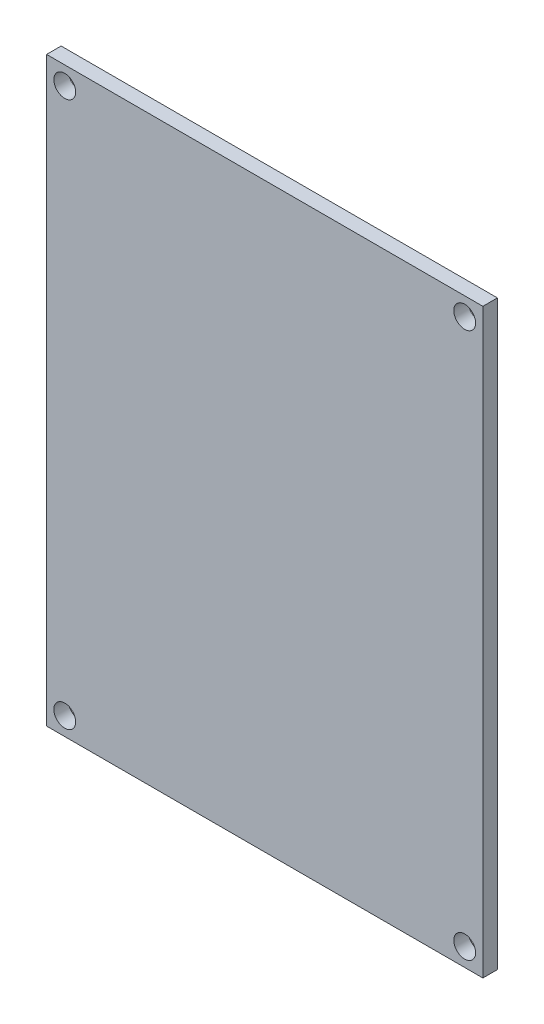
ISO-10303-21;
HEADER;
FILE_DESCRIPTION(('STEP AP214'),'2;1');
FILE_NAME('part.step','',(''),(''),'','','');
FILE_SCHEMA(('AUTOMOTIVE_DESIGN { 1 0 10303 214 1 1 1 1 }'));
ENDSEC;
DATA;
#1=APPLICATION_CONTEXT('core data for automotive mechanical design processes');
#2=APPLICATION_PROTOCOL_DEFINITION('international standard','automotive_design',2000,#1);
#3=PRODUCT_CONTEXT('',#1,'mechanical');
#4=PRODUCT('Part','Part','',(#3));
#5=PRODUCT_RELATED_PRODUCT_CATEGORY('part','',(#4));
#6=PRODUCT_DEFINITION_FORMATION('','',#4);
#7=PRODUCT_DEFINITION_CONTEXT('part definition',#1,'design');
#8=PRODUCT_DEFINITION('design','',#6,#7);
#9=PRODUCT_DEFINITION_SHAPE('','',#8);
#10=(LENGTH_UNIT() NAMED_UNIT(*) SI_UNIT(.MILLI.,.METRE.));
#11=(NAMED_UNIT(*) PLANE_ANGLE_UNIT() SI_UNIT($,.RADIAN.));
#12=(NAMED_UNIT(*) SI_UNIT($,.STERADIAN.) SOLID_ANGLE_UNIT());
#13=UNCERTAINTY_MEASURE_WITH_UNIT(LENGTH_MEASURE(1.E-05),#10,'distance_accuracy_value','');
#14=(GEOMETRIC_REPRESENTATION_CONTEXT(3) GLOBAL_UNCERTAINTY_ASSIGNED_CONTEXT((#13)) GLOBAL_UNIT_ASSIGNED_CONTEXT((#10,
#11,#12)) REPRESENTATION_CONTEXT('',''));
#15=CARTESIAN_POINT('',(0.,0.,0.));
#16=DIRECTION('',(0.,0.,1.));
#17=DIRECTION('',(1.,0.,0.));
#18=AXIS2_PLACEMENT_3D('',#15,#16,#17);
#19=CARTESIAN_POINT('',(-30.,-40.,2.));
#20=DIRECTION('',(1.,0.,0.));
#21=DIRECTION('',(0.,0.,-1.));
#22=AXIS2_PLACEMENT_3D('',#19,#20,#21);
#23=PLANE('',#22);
#24=DIRECTION('',(0.,-1.,0.));
#25=VECTOR('',#24,1.);
#26=CARTESIAN_POINT('',(-30.,-40.,0.));
#27=LINE('',#26,#25);
#28=CARTESIAN_POINT('',(-30.,40.,0.));
#29=VERTEX_POINT('',#28);
#30=CARTESIAN_POINT('',(-30.,-40.,0.));
#31=VERTEX_POINT('',#30);
#32=EDGE_CURVE('E96',#29,#31,#27,.T.);
#33=ORIENTED_EDGE('',*,*,#32,.T.);
#34=DIRECTION('',(0.,0.,-1.));
#35=VECTOR('',#34,1.);
#36=CARTESIAN_POINT('',(-30.,-40.,2.));
#37=LINE('',#36,#35);
#38=CARTESIAN_POINT('',(-30.,-40.,2.));
#39=VERTEX_POINT('',#38);
#40=EDGE_CURVE('E11',#39,#31,#37,.T.);
#41=ORIENTED_EDGE('',*,*,#40,.F.);
#42=DIRECTION('',(0.,-1.,0.));
#43=VECTOR('',#42,1.);
#44=CARTESIAN_POINT('',(-30.,-40.,2.));
#45=LINE('',#44,#43);
#46=CARTESIAN_POINT('',(-30.,40.,2.));
#47=VERTEX_POINT('',#46);
#48=EDGE_CURVE('E84',#47,#39,#45,.T.);
#49=ORIENTED_EDGE('',*,*,#48,.F.);
#50=DIRECTION('',(0.,0.,-1.));
#51=VECTOR('',#50,1.);
#52=CARTESIAN_POINT('',(-30.,40.,2.));
#53=LINE('',#52,#51);
#54=EDGE_CURVE('E92',#47,#29,#53,.T.);
#55=ORIENTED_EDGE('',*,*,#54,.T.);
#56=EDGE_LOOP('',(#33,#41,#49,#55));
#57=FACE_BOUND('',#56,.T.);
#58=ADVANCED_FACE('F33',(#57),#23,.F.);
#59=CARTESIAN_POINT('',(30.,-40.,2.));
#60=DIRECTION('',(0.,1.,0.));
#61=DIRECTION('',(0.,0.,1.));
#62=AXIS2_PLACEMENT_3D('',#59,#60,#61);
#63=PLANE('',#62);
#64=DIRECTION('',(1.,0.,0.));
#65=VECTOR('',#64,1.);
#66=CARTESIAN_POINT('',(30.,-40.,0.));
#67=LINE('',#66,#65);
#68=CARTESIAN_POINT('',(30.,-40.,0.));
#69=VERTEX_POINT('',#68);
#70=EDGE_CURVE('E88',#31,#69,#67,.T.);
#71=ORIENTED_EDGE('',*,*,#70,.T.);
#72=DIRECTION('',(0.,0.,-1.));
#73=VECTOR('',#72,1.);
#74=CARTESIAN_POINT('',(30.,-40.,2.));
#75=LINE('',#74,#73);
#76=CARTESIAN_POINT('',(30.,-40.,2.));
#77=VERTEX_POINT('',#76);
#78=EDGE_CURVE('E41',#77,#69,#75,.T.);
#79=ORIENTED_EDGE('',*,*,#78,.F.);
#80=DIRECTION('',(1.,0.,0.));
#81=VECTOR('',#80,1.);
#82=CARTESIAN_POINT('',(30.,-40.,2.));
#83=LINE('',#82,#81);
#84=EDGE_CURVE('E79',#39,#77,#83,.T.);
#85=ORIENTED_EDGE('',*,*,#84,.F.);
#86=ORIENTED_EDGE('',*,*,#40,.T.);
#87=EDGE_LOOP('',(#71,#79,#85,#86));
#88=FACE_BOUND('',#87,.T.);
#89=ADVANCED_FACE('F87',(#88),#63,.F.);
#90=CARTESIAN_POINT('',(30.,-40.,2.));
#91=DIRECTION('',(-1.,0.,0.));
#92=DIRECTION('',(0.,0.,1.));
#93=AXIS2_PLACEMENT_3D('',#90,#91,#92);
#94=PLANE('',#93);
#95=DIRECTION('',(0.,1.,0.));
#96=VECTOR('',#95,1.);
#97=CARTESIAN_POINT('',(30.,-40.,0.));
#98=LINE('',#97,#96);
#99=CARTESIAN_POINT('',(30.,40.,0.));
#100=VERTEX_POINT('',#99);
#101=EDGE_CURVE('E66',#69,#100,#98,.T.);
#102=ORIENTED_EDGE('',*,*,#101,.T.);
#103=DIRECTION('',(0.,0.,-1.));
#104=VECTOR('',#103,1.);
#105=CARTESIAN_POINT('',(30.,40.,2.));
#106=LINE('',#105,#104);
#107=CARTESIAN_POINT('',(30.,40.,2.));
#108=VERTEX_POINT('',#107);
#109=EDGE_CURVE('E89',#108,#100,#106,.T.);
#110=ORIENTED_EDGE('',*,*,#109,.F.);
#111=DIRECTION('',(0.,1.,0.));
#112=VECTOR('',#111,1.);
#113=CARTESIAN_POINT('',(30.,-40.,2.));
#114=LINE('',#113,#112);
#115=EDGE_CURVE('E82',#77,#108,#114,.T.);
#116=ORIENTED_EDGE('',*,*,#115,.F.);
#117=ORIENTED_EDGE('',*,*,#78,.T.);
#118=EDGE_LOOP('',(#102,#110,#116,#117));
#119=FACE_BOUND('',#118,.T.);
#120=ADVANCED_FACE('F90',(#119),#94,.F.);
#121=CARTESIAN_POINT('',(30.,40.,2.));
#122=DIRECTION('',(0.,-1.,0.));
#123=DIRECTION('',(0.,0.,-1.));
#124=AXIS2_PLACEMENT_3D('',#121,#122,#123);
#125=PLANE('',#124);
#126=DIRECTION('',(-1.,0.,0.));
#127=VECTOR('',#126,1.);
#128=CARTESIAN_POINT('',(30.,40.,0.));
#129=LINE('',#128,#127);
#130=EDGE_CURVE('E72',#100,#29,#129,.T.);
#131=ORIENTED_EDGE('',*,*,#130,.T.);
#132=ORIENTED_EDGE('',*,*,#54,.F.);
#133=DIRECTION('',(-1.,0.,0.));
#134=VECTOR('',#133,1.);
#135=CARTESIAN_POINT('',(30.,40.,2.));
#136=LINE('',#135,#134);
#137=EDGE_CURVE('E49',#108,#47,#136,.T.);
#138=ORIENTED_EDGE('',*,*,#137,.F.);
#139=ORIENTED_EDGE('',*,*,#109,.T.);
#140=EDGE_LOOP('',(#131,#132,#138,#139));
#141=FACE_BOUND('',#140,.T.);
#142=ADVANCED_FACE('F104',(#141),#125,.F.);
#143=CARTESIAN_POINT('',(0.,0.,2.));
#144=DIRECTION('',(0.,0.,1.));
#145=DIRECTION('',(1.,0.,0.));
#146=AXIS2_PLACEMENT_3D('',#143,#144,#145);
#147=PLANE('',#146);
#148=CARTESIAN_POINT('',(-27.4999999999998,37.5,2.));
#149=DIRECTION('',(0.,0.,1.));
#150=DIRECTION('',(1.,0.,0.));
#151=AXIS2_PLACEMENT_3D('',#148,#149,#150);
#152=CIRCLE('',#151,1.5);
#153=CARTESIAN_POINT('',(-25.9999999999998,37.5,2.));
#154=VERTEX_POINT('',#153);
#155=EDGE_CURVE('E116',#154,#154,#152,.F.);
#156=ORIENTED_EDGE('',*,*,#155,.T.);
#157=EDGE_LOOP('',(#156));
#158=FACE_BOUND('',#157,.T.);
#159=CARTESIAN_POINT('',(27.5000000000001,37.4999999999998,2.));
#160=DIRECTION('',(0.,0.,1.));
#161=DIRECTION('',(1.,0.,0.));
#162=AXIS2_PLACEMENT_3D('',#159,#160,#161);
#163=CIRCLE('',#162,1.5);
#164=CARTESIAN_POINT('',(29.0000000000001,37.4999999999998,2.));
#165=VERTEX_POINT('',#164);
#166=EDGE_CURVE('E122',#165,#165,#163,.F.);
#167=ORIENTED_EDGE('',*,*,#166,.T.);
#168=EDGE_LOOP('',(#167));
#169=FACE_BOUND('',#168,.T.);
#170=CARTESIAN_POINT('',(27.4999999999999,-37.5000000000001,2.));
#171=DIRECTION('',(0.,0.,1.));
#172=DIRECTION('',(1.,0.,0.));
#173=AXIS2_PLACEMENT_3D('',#170,#171,#172);
#174=CIRCLE('',#173,1.5);
#175=CARTESIAN_POINT('',(28.9999999999999,-37.5000000000001,2.));
#176=VERTEX_POINT('',#175);
#177=EDGE_CURVE('E128',#176,#176,#174,.F.);
#178=ORIENTED_EDGE('',*,*,#177,.T.);
#179=EDGE_LOOP('',(#178));
#180=FACE_BOUND('',#179,.T.);
#181=CARTESIAN_POINT('',(-27.5,-37.5,2.));
#182=DIRECTION('',(0.,0.,1.));
#183=DIRECTION('',(1.,0.,0.));
#184=AXIS2_PLACEMENT_3D('',#181,#182,#183);
#185=CIRCLE('',#184,1.5);
#186=CARTESIAN_POINT('',(-26.,-37.5,2.));
#187=VERTEX_POINT('',#186);
#188=EDGE_CURVE('E110',#187,#187,#185,.F.);
#189=ORIENTED_EDGE('',*,*,#188,.T.);
#190=EDGE_LOOP('',(#189));
#191=FACE_BOUND('',#190,.T.);
#192=ORIENTED_EDGE('',*,*,#48,.T.);
#193=ORIENTED_EDGE('',*,*,#84,.T.);
#194=ORIENTED_EDGE('',*,*,#115,.T.);
#195=ORIENTED_EDGE('',*,*,#137,.T.);
#196=EDGE_LOOP('',(#192,#193,#194,#195));
#197=FACE_BOUND('',#196,.T.);
#198=ADVANCED_FACE('F80',(#158,#169,#180,#191,#197),#147,.T.);
#199=CARTESIAN_POINT('',(0.,0.,0.));
#200=DIRECTION('',(0.,0.,1.));
#201=DIRECTION('',(1.,0.,0.));
#202=AXIS2_PLACEMENT_3D('',#199,#200,#201);
#203=PLANE('',#202);
#204=CARTESIAN_POINT('',(-27.4999999999998,37.5,0.));
#205=DIRECTION('',(0.,0.,-1.));
#206=DIRECTION('',(-1.,0.,0.));
#207=AXIS2_PLACEMENT_3D('',#204,#205,#206);
#208=CIRCLE('',#207,1.5);
#209=CARTESIAN_POINT('',(-28.9999999999998,37.5,0.));
#210=VERTEX_POINT('',#209);
#211=EDGE_CURVE('E119',#210,#210,#208,.T.);
#212=ORIENTED_EDGE('',*,*,#211,.F.);
#213=EDGE_LOOP('',(#212));
#214=FACE_BOUND('',#213,.T.);
#215=CARTESIAN_POINT('',(27.5000000000001,37.4999999999998,0.));
#216=DIRECTION('',(0.,0.,-1.));
#217=DIRECTION('',(-1.,0.,0.));
#218=AXIS2_PLACEMENT_3D('',#215,#216,#217);
#219=CIRCLE('',#218,1.5);
#220=CARTESIAN_POINT('',(26.0000000000001,37.4999999999998,0.));
#221=VERTEX_POINT('',#220);
#222=EDGE_CURVE('E125',#221,#221,#219,.T.);
#223=ORIENTED_EDGE('',*,*,#222,.F.);
#224=EDGE_LOOP('',(#223));
#225=FACE_BOUND('',#224,.T.);
#226=CARTESIAN_POINT('',(27.4999999999999,-37.5000000000001,0.));
#227=DIRECTION('',(0.,0.,-1.));
#228=DIRECTION('',(-1.,0.,0.));
#229=AXIS2_PLACEMENT_3D('',#226,#227,#228);
#230=CIRCLE('',#229,1.5);
#231=CARTESIAN_POINT('',(25.9999999999999,-37.5000000000001,0.));
#232=VERTEX_POINT('',#231);
#233=EDGE_CURVE('E113',#232,#232,#230,.T.);
#234=ORIENTED_EDGE('',*,*,#233,.F.);
#235=EDGE_LOOP('',(#234));
#236=FACE_BOUND('',#235,.T.);
#237=CARTESIAN_POINT('',(-27.5,-37.5,0.));
#238=DIRECTION('',(0.,0.,-1.));
#239=DIRECTION('',(-1.,0.,0.));
#240=AXIS2_PLACEMENT_3D('',#237,#238,#239);
#241=CIRCLE('',#240,1.5);
#242=CARTESIAN_POINT('',(-29.,-37.5,0.));
#243=VERTEX_POINT('',#242);
#244=EDGE_CURVE('E99',#243,#243,#241,.T.);
#245=ORIENTED_EDGE('',*,*,#244,.F.);
#246=EDGE_LOOP('',(#245));
#247=FACE_BOUND('',#246,.T.);
#248=ORIENTED_EDGE('',*,*,#32,.F.);
#249=ORIENTED_EDGE('',*,*,#130,.F.);
#250=ORIENTED_EDGE('',*,*,#101,.F.);
#251=ORIENTED_EDGE('',*,*,#70,.F.);
#252=EDGE_LOOP('',(#248,#249,#250,#251));
#253=FACE_BOUND('',#252,.T.);
#254=ADVANCED_FACE('F107',(#214,#225,#236,#247,#253),#203,.F.);
#255=CARTESIAN_POINT('',(-27.5,-37.5,2.001));
#256=DIRECTION('',(0.,0.,-1.));
#257=DIRECTION('',(-1.,0.,0.));
#258=AXIS2_PLACEMENT_3D('',#255,#256,#257);
#259=CYLINDRICAL_SURFACE('',#258,1.5);
#260=ORIENTED_EDGE('',*,*,#188,.F.);
#261=EDGE_LOOP('',(#260));
#262=FACE_BOUND('',#261,.T.);
#263=ORIENTED_EDGE('',*,*,#244,.T.);
#264=EDGE_LOOP('',(#263));
#265=FACE_BOUND('',#264,.T.);
#266=ADVANCED_FACE('F138',(#262,#265),#259,.F.);
#267=CARTESIAN_POINT('',(27.4999999999999,-37.5000000000001,2.001));
#268=DIRECTION('',(0.,0.,-1.));
#269=DIRECTION('',(-1.,0.,0.));
#270=AXIS2_PLACEMENT_3D('',#267,#268,#269);
#271=CYLINDRICAL_SURFACE('',#270,1.5);
#272=ORIENTED_EDGE('',*,*,#177,.F.);
#273=EDGE_LOOP('',(#272));
#274=FACE_BOUND('',#273,.T.);
#275=ORIENTED_EDGE('',*,*,#233,.T.);
#276=EDGE_LOOP('',(#275));
#277=FACE_BOUND('',#276,.T.);
#278=ADVANCED_FACE('F134',(#274,#277),#271,.F.);
#279=CARTESIAN_POINT('',(27.5000000000001,37.4999999999998,2.001));
#280=DIRECTION('',(0.,0.,-1.));
#281=DIRECTION('',(-1.,0.,0.));
#282=AXIS2_PLACEMENT_3D('',#279,#280,#281);
#283=CYLINDRICAL_SURFACE('',#282,1.5);
#284=ORIENTED_EDGE('',*,*,#166,.F.);
#285=EDGE_LOOP('',(#284));
#286=FACE_BOUND('',#285,.T.);
#287=ORIENTED_EDGE('',*,*,#222,.T.);
#288=EDGE_LOOP('',(#287));
#289=FACE_BOUND('',#288,.T.);
#290=ADVANCED_FACE('F149',(#286,#289),#283,.F.);
#291=CARTESIAN_POINT('',(-27.4999999999998,37.5,2.001));
#292=DIRECTION('',(0.,0.,-1.));
#293=DIRECTION('',(-1.,0.,0.));
#294=AXIS2_PLACEMENT_3D('',#291,#292,#293);
#295=CYLINDRICAL_SURFACE('',#294,1.5);
#296=ORIENTED_EDGE('',*,*,#155,.F.);
#297=EDGE_LOOP('',(#296));
#298=FACE_BOUND('',#297,.T.);
#299=ORIENTED_EDGE('',*,*,#211,.T.);
#300=EDGE_LOOP('',(#299));
#301=FACE_BOUND('',#300,.T.);
#302=ADVANCED_FACE('F178',(#298,#301),#295,.F.);
#303=CLOSED_SHELL('',(#58,#89,#120,#142,#198,#254,#266,#278,#290,#302));
#304=MANIFOLD_SOLID_BREP('B2',#303);
#305=ADVANCED_BREP_SHAPE_REPRESENTATION('',(#18,#304),#14);
#306=SHAPE_DEFINITION_REPRESENTATION(#9,#305);
ENDSEC;
END-ISO-10303-21;
